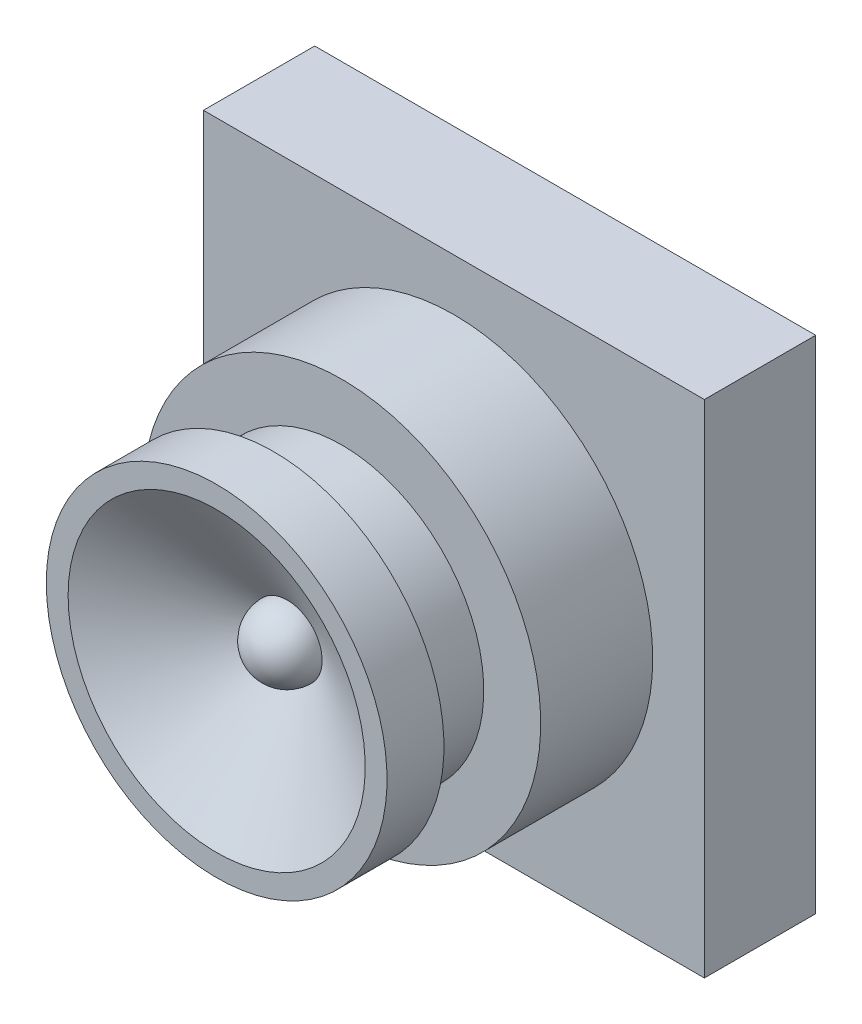
ISO-10303-21;
HEADER;
FILE_DESCRIPTION(('STEP AP214'),'2;1');
FILE_NAME('part.step','',(''),(''),'','','');
FILE_SCHEMA(('AUTOMOTIVE_DESIGN { 1 0 10303 214 1 1 1 1 }'));
ENDSEC;
DATA;
#1=APPLICATION_CONTEXT('core data for automotive mechanical design processes');
#2=APPLICATION_PROTOCOL_DEFINITION('international standard','automotive_design',2000,#1);
#3=PRODUCT_CONTEXT('',#1,'mechanical');
#4=PRODUCT('Part','Part','',(#3));
#5=PRODUCT_RELATED_PRODUCT_CATEGORY('part','',(#4));
#6=PRODUCT_DEFINITION_FORMATION('','',#4);
#7=PRODUCT_DEFINITION_CONTEXT('part definition',#1,'design');
#8=PRODUCT_DEFINITION('design','',#6,#7);
#9=PRODUCT_DEFINITION_SHAPE('','',#8);
#10=(LENGTH_UNIT() NAMED_UNIT(*) SI_UNIT(.MILLI.,.METRE.));
#11=(NAMED_UNIT(*) PLANE_ANGLE_UNIT() SI_UNIT($,.RADIAN.));
#12=(NAMED_UNIT(*) SI_UNIT($,.STERADIAN.) SOLID_ANGLE_UNIT());
#13=UNCERTAINTY_MEASURE_WITH_UNIT(LENGTH_MEASURE(1.E-05),#10,'distance_accuracy_value','');
#14=(GEOMETRIC_REPRESENTATION_CONTEXT(3) GLOBAL_UNCERTAINTY_ASSIGNED_CONTEXT((#13)) GLOBAL_UNIT_ASSIGNED_CONTEXT((#10,
#11,#12)) REPRESENTATION_CONTEXT('',''));
#15=CARTESIAN_POINT('',(0.,0.,0.));
#16=DIRECTION('',(0.,0.,1.));
#17=DIRECTION('',(1.,0.,0.));
#18=AXIS2_PLACEMENT_3D('',#15,#16,#17);
#19=CARTESIAN_POINT('',(-9.,9.,4.));
#20=DIRECTION('',(1.,0.,0.));
#21=DIRECTION('',(0.,1.,0.));
#22=AXIS2_PLACEMENT_3D('',#19,#20,#21);
#23=PLANE('',#22);
#24=DIRECTION('',(0.,-1.,0.));
#25=VECTOR('',#24,1.);
#26=CARTESIAN_POINT('',(-9.,9.,0.));
#27=LINE('',#26,#25);
#28=CARTESIAN_POINT('',(-9.,9.,0.));
#29=VERTEX_POINT('',#28);
#30=CARTESIAN_POINT('',(-9.,-9.,0.));
#31=VERTEX_POINT('',#30);
#32=EDGE_CURVE('E121',#29,#31,#27,.T.);
#33=ORIENTED_EDGE('',*,*,#32,.T.);
#34=DIRECTION('',(0.,0.,-1.));
#35=VECTOR('',#34,1.);
#36=CARTESIAN_POINT('',(-9.,-9.,4.));
#37=LINE('',#36,#35);
#38=CARTESIAN_POINT('',(-9.,-9.,4.));
#39=VERTEX_POINT('',#38);
#40=EDGE_CURVE('E42',#39,#31,#37,.T.);
#41=ORIENTED_EDGE('',*,*,#40,.F.);
#42=DIRECTION('',(0.,-1.,0.));
#43=VECTOR('',#42,1.);
#44=CARTESIAN_POINT('',(-9.,9.,4.));
#45=LINE('',#44,#43);
#46=CARTESIAN_POINT('',(-9.,9.,4.));
#47=VERTEX_POINT('',#46);
#48=EDGE_CURVE('E122',#47,#39,#45,.T.);
#49=ORIENTED_EDGE('',*,*,#48,.F.);
#50=DIRECTION('',(0.,0.,-1.));
#51=VECTOR('',#50,1.);
#52=CARTESIAN_POINT('',(-9.,9.,4.));
#53=LINE('',#52,#51);
#54=EDGE_CURVE('E128',#47,#29,#53,.T.);
#55=ORIENTED_EDGE('',*,*,#54,.T.);
#56=EDGE_LOOP('',(#33,#41,#49,#55));
#57=FACE_BOUND('',#56,.T.);
#58=ADVANCED_FACE('F34',(#57),#23,.F.);
#59=CARTESIAN_POINT('',(-9.,-9.,4.));
#60=DIRECTION('',(0.,1.,0.));
#61=DIRECTION('',(0.,0.,1.));
#62=AXIS2_PLACEMENT_3D('',#59,#60,#61);
#63=PLANE('',#62);
#64=DIRECTION('',(1.,0.,0.));
#65=VECTOR('',#64,1.);
#66=CARTESIAN_POINT('',(-9.,-9.,0.));
#67=LINE('',#66,#65);
#68=CARTESIAN_POINT('',(9.,-9.,0.));
#69=VERTEX_POINT('',#68);
#70=EDGE_CURVE('E131',#31,#69,#67,.T.);
#71=ORIENTED_EDGE('',*,*,#70,.T.);
#72=DIRECTION('',(0.,0.,-1.));
#73=VECTOR('',#72,1.);
#74=CARTESIAN_POINT('',(9.,-9.,4.));
#75=LINE('',#74,#73);
#76=CARTESIAN_POINT('',(9.,-9.,4.));
#77=VERTEX_POINT('',#76);
#78=EDGE_CURVE('E138',#77,#69,#75,.T.);
#79=ORIENTED_EDGE('',*,*,#78,.F.);
#80=DIRECTION('',(1.,0.,0.));
#81=VECTOR('',#80,1.);
#82=CARTESIAN_POINT('',(-9.,-9.,4.));
#83=LINE('',#82,#81);
#84=EDGE_CURVE('E82',#39,#77,#83,.T.);
#85=ORIENTED_EDGE('',*,*,#84,.F.);
#86=ORIENTED_EDGE('',*,*,#40,.T.);
#87=EDGE_LOOP('',(#71,#79,#85,#86));
#88=FACE_BOUND('',#87,.T.);
#89=ADVANCED_FACE('F140',(#88),#63,.F.);
#90=CARTESIAN_POINT('',(9.,9.,4.));
#91=DIRECTION('',(-1.,0.,0.));
#92=DIRECTION('',(0.,-1.,0.));
#93=AXIS2_PLACEMENT_3D('',#90,#91,#92);
#94=PLANE('',#93);
#95=DIRECTION('',(0.,1.,0.));
#96=VECTOR('',#95,1.);
#97=CARTESIAN_POINT('',(9.,9.,0.));
#98=LINE('',#97,#96);
#99=CARTESIAN_POINT('',(9.,9.,0.));
#100=VERTEX_POINT('',#99);
#101=EDGE_CURVE('E68',#69,#100,#98,.T.);
#102=ORIENTED_EDGE('',*,*,#101,.T.);
#103=DIRECTION('',(0.,0.,-1.));
#104=VECTOR('',#103,1.);
#105=CARTESIAN_POINT('',(9.,9.,4.));
#106=LINE('',#105,#104);
#107=CARTESIAN_POINT('',(9.,9.,4.));
#108=VERTEX_POINT('',#107);
#109=EDGE_CURVE('E136',#108,#100,#106,.T.);
#110=ORIENTED_EDGE('',*,*,#109,.F.);
#111=DIRECTION('',(0.,1.,0.));
#112=VECTOR('',#111,1.);
#113=CARTESIAN_POINT('',(9.,9.,4.));
#114=LINE('',#113,#112);
#115=EDGE_CURVE('E125',#77,#108,#114,.T.);
#116=ORIENTED_EDGE('',*,*,#115,.F.);
#117=ORIENTED_EDGE('',*,*,#78,.T.);
#118=EDGE_LOOP('',(#102,#110,#116,#117));
#119=FACE_BOUND('',#118,.T.);
#120=ADVANCED_FACE('F165',(#119),#94,.F.);
#121=CARTESIAN_POINT('',(-9.,9.,4.));
#122=DIRECTION('',(0.,-1.,0.));
#123=DIRECTION('',(1.,0.,0.));
#124=AXIS2_PLACEMENT_3D('',#121,#122,#123);
#125=PLANE('',#124);
#126=DIRECTION('',(-1.,0.,0.));
#127=VECTOR('',#126,1.);
#128=CARTESIAN_POINT('',(-9.,9.,0.));
#129=LINE('',#128,#127);
#130=EDGE_CURVE('E74',#100,#29,#129,.T.);
#131=ORIENTED_EDGE('',*,*,#130,.T.);
#132=ORIENTED_EDGE('',*,*,#54,.F.);
#133=DIRECTION('',(-1.,0.,0.));
#134=VECTOR('',#133,1.);
#135=CARTESIAN_POINT('',(-9.,9.,4.));
#136=LINE('',#135,#134);
#137=EDGE_CURVE('E50',#108,#47,#136,.T.);
#138=ORIENTED_EDGE('',*,*,#137,.F.);
#139=ORIENTED_EDGE('',*,*,#109,.T.);
#140=EDGE_LOOP('',(#131,#132,#138,#139));
#141=FACE_BOUND('',#140,.T.);
#142=ADVANCED_FACE('F157',(#141),#125,.F.);
#143=CARTESIAN_POINT('',(-9.,-9.,4.));
#144=DIRECTION('',(0.,0.,1.));
#145=DIRECTION('',(1.,0.,0.));
#146=AXIS2_PLACEMENT_3D('',#143,#144,#145);
#147=PLANE('',#146);
#148=CARTESIAN_POINT('',(0.,0.,4.));
#149=DIRECTION('',(0.,0.,1.));
#150=DIRECTION('',(1.,0.,0.));
#151=AXIS2_PLACEMENT_3D('',#148,#149,#150);
#152=CIRCLE('',#151,7.14368068395709);
#153=CARTESIAN_POINT('',(7.14368068395709,0.,4.));
#154=VERTEX_POINT('',#153);
#155=EDGE_CURVE('E11',#154,#154,#152,.T.);
#156=ORIENTED_EDGE('',*,*,#155,.F.);
#157=EDGE_LOOP('',(#156));
#158=FACE_BOUND('',#157,.T.);
#159=ORIENTED_EDGE('',*,*,#48,.T.);
#160=ORIENTED_EDGE('',*,*,#84,.T.);
#161=ORIENTED_EDGE('',*,*,#115,.T.);
#162=ORIENTED_EDGE('',*,*,#137,.T.);
#163=EDGE_LOOP('',(#159,#160,#161,#162));
#164=FACE_BOUND('',#163,.T.);
#165=ADVANCED_FACE('F148',(#158,#164),#147,.T.);
#166=CARTESIAN_POINT('',(-9.,-9.,0.));
#167=DIRECTION('',(0.,0.,1.));
#168=DIRECTION('',(1.,0.,0.));
#169=AXIS2_PLACEMENT_3D('',#166,#167,#168);
#170=PLANE('',#169);
#171=ORIENTED_EDGE('',*,*,#32,.F.);
#172=ORIENTED_EDGE('',*,*,#130,.F.);
#173=ORIENTED_EDGE('',*,*,#101,.F.);
#174=ORIENTED_EDGE('',*,*,#70,.F.);
#175=EDGE_LOOP('',(#171,#172,#173,#174));
#176=FACE_BOUND('',#175,.T.);
#177=ADVANCED_FACE('F145',(#176),#170,.F.);
#178=CARTESIAN_POINT('',(0.,0.,0.));
#179=DIRECTION('',(0.,0.,-1.));
#180=DIRECTION('',(-1.,0.,0.));
#181=AXIS2_PLACEMENT_3D('',#178,#179,#180);
#182=CYLINDRICAL_SURFACE('',#181,7.14368068395709);
#183=CARTESIAN_POINT('',(0.,0.,8.0246727547928));
#184=DIRECTION('',(0.,0.,-1.));
#185=DIRECTION('',(-1.,0.,0.));
#186=AXIS2_PLACEMENT_3D('',#183,#184,#185);
#187=CIRCLE('',#186,7.14368068395709);
#188=CARTESIAN_POINT('',(-7.14368068395709,0.,8.0246727547928));
#189=VERTEX_POINT('',#188);
#190=EDGE_CURVE('E118',#189,#189,#187,.T.);
#191=ORIENTED_EDGE('',*,*,#190,.T.);
#192=EDGE_LOOP('',(#191));
#193=FACE_BOUND('',#192,.T.);
#194=ORIENTED_EDGE('',*,*,#155,.T.);
#195=EDGE_LOOP('',(#194));
#196=FACE_BOUND('',#195,.T.);
#197=ADVANCED_FACE('F147',(#193,#196),#182,.T.);
#198=CARTESIAN_POINT('',(-7.14368068395709,0.,8.0246727547928));
#199=DIRECTION('',(0.,0.,1.));
#200=DIRECTION('',(1.,0.,0.));
#201=AXIS2_PLACEMENT_3D('',#198,#199,#200);
#202=PLANE('',#201);
#203=CARTESIAN_POINT('',(0.,0.,8.0246727547928));
#204=DIRECTION('',(0.,0.,-1.));
#205=DIRECTION('',(-1.,0.,0.));
#206=AXIS2_PLACEMENT_3D('',#203,#204,#205);
#207=CIRCLE('',#206,5.09873392328235);
#208=CARTESIAN_POINT('',(-5.09873392328235,0.,8.0246727547928));
#209=VERTEX_POINT('',#208);
#210=EDGE_CURVE('E115',#209,#209,#207,.T.);
#211=ORIENTED_EDGE('',*,*,#210,.T.);
#212=EDGE_LOOP('',(#211));
#213=FACE_BOUND('',#212,.T.);
#214=ORIENTED_EDGE('',*,*,#190,.F.);
#215=EDGE_LOOP('',(#214));
#216=FACE_BOUND('',#215,.T.);
#217=ADVANCED_FACE('F154',(#213,#216),#202,.T.);
#218=CARTESIAN_POINT('',(0.,0.,0.));
#219=DIRECTION('',(0.,0.,-1.));
#220=DIRECTION('',(-1.,0.,0.));
#221=AXIS2_PLACEMENT_3D('',#218,#219,#220);
#222=CYLINDRICAL_SURFACE('',#221,5.09873392328235);
#223=CARTESIAN_POINT('',(0.,0.,9.98782164504055));
#224=DIRECTION('',(0.,0.,-1.));
#225=DIRECTION('',(-1.,0.,0.));
#226=AXIS2_PLACEMENT_3D('',#223,#224,#225);
#227=CIRCLE('',#226,5.09873392328235);
#228=CARTESIAN_POINT('',(-5.09873392328235,0.,9.98782164504055));
#229=VERTEX_POINT('',#228);
#230=EDGE_CURVE('E112',#229,#229,#227,.T.);
#231=ORIENTED_EDGE('',*,*,#230,.T.);
#232=EDGE_LOOP('',(#231));
#233=FACE_BOUND('',#232,.T.);
#234=ORIENTED_EDGE('',*,*,#210,.F.);
#235=EDGE_LOOP('',(#234));
#236=FACE_BOUND('',#235,.T.);
#237=ADVANCED_FACE('F196',(#233,#236),#222,.T.);
#238=CARTESIAN_POINT('',(-5.09873392328235,0.,9.98782164504055));
#239=DIRECTION('',(0.,0.,1.));
#240=DIRECTION('',(1.,0.,0.));
#241=AXIS2_PLACEMENT_3D('',#238,#239,#240);
#242=PLANE('',#241);
#243=CARTESIAN_POINT('',(0.,0.,9.98782164504055));
#244=DIRECTION('',(0.,0.,-1.));
#245=DIRECTION('',(-1.,0.,0.));
#246=AXIS2_PLACEMENT_3D('',#243,#244,#245);
#247=CIRCLE('',#246,4.55341478710242);
#248=CARTESIAN_POINT('',(-4.55341478710242,0.,9.98782164504055));
#249=VERTEX_POINT('',#248);
#250=EDGE_CURVE('E109',#249,#249,#247,.T.);
#251=ORIENTED_EDGE('',*,*,#250,.T.);
#252=EDGE_LOOP('',(#251));
#253=FACE_BOUND('',#252,.T.);
#254=ORIENTED_EDGE('',*,*,#230,.F.);
#255=EDGE_LOOP('',(#254));
#256=FACE_BOUND('',#255,.T.);
#257=ADVANCED_FACE('F206',(#253,#256),#242,.T.);
#258=CARTESIAN_POINT('',(0.,0.,0.));
#259=DIRECTION('',(0.,0.,-1.));
#260=DIRECTION('',(-1.,0.,0.));
#261=AXIS2_PLACEMENT_3D('',#258,#259,#260);
#262=CYLINDRICAL_SURFACE('',#261,4.55341478710242);
#263=CARTESIAN_POINT('',(0.,0.,10.4786088676025));
#264=DIRECTION('',(0.,0.,-1.));
#265=DIRECTION('',(-1.,0.,0.));
#266=AXIS2_PLACEMENT_3D('',#263,#264,#265);
#267=CIRCLE('',#266,4.55341478710242);
#268=CARTESIAN_POINT('',(-4.55341478710242,0.,10.4786088676025));
#269=VERTEX_POINT('',#268);
#270=EDGE_CURVE('E106',#269,#269,#267,.T.);
#271=ORIENTED_EDGE('',*,*,#270,.T.);
#272=EDGE_LOOP('',(#271));
#273=FACE_BOUND('',#272,.T.);
#274=ORIENTED_EDGE('',*,*,#250,.F.);
#275=EDGE_LOOP('',(#274));
#276=FACE_BOUND('',#275,.T.);
#277=ADVANCED_FACE('F216',(#273,#276),#262,.T.);
#278=CARTESIAN_POINT('',(-4.55341478710242,0.,10.4786088676025));
#279=DIRECTION('',(0.,0.,-1.));
#280=DIRECTION('',(-1.,0.,0.));
#281=AXIS2_PLACEMENT_3D('',#278,#279,#280);
#282=PLANE('',#281);
#283=CARTESIAN_POINT('',(0.,0.,10.4786088676025));
#284=DIRECTION('',(0.,0.,-1.));
#285=DIRECTION('',(-1.,0.,0.));
#286=AXIS2_PLACEMENT_3D('',#283,#284,#285);
#287=CIRCLE('',#286,6.12120730361972);
#288=CARTESIAN_POINT('',(-6.12120730361972,0.,10.4786088676025));
#289=VERTEX_POINT('',#288);
#290=EDGE_CURVE('E103',#289,#289,#287,.T.);
#291=ORIENTED_EDGE('',*,*,#290,.T.);
#292=EDGE_LOOP('',(#291));
#293=FACE_BOUND('',#292,.T.);
#294=ORIENTED_EDGE('',*,*,#270,.F.);
#295=EDGE_LOOP('',(#294));
#296=FACE_BOUND('',#295,.T.);
#297=ADVANCED_FACE('F226',(#293,#296),#282,.T.);
#298=CARTESIAN_POINT('',(0.,0.,0.));
#299=DIRECTION('',(0.,0.,-1.));
#300=DIRECTION('',(-1.,0.,0.));
#301=AXIS2_PLACEMENT_3D('',#298,#299,#300);
#302=CYLINDRICAL_SURFACE('',#301,6.12120730361972);
#303=CARTESIAN_POINT('',(0.,0.,12.5235556282772));
#304=DIRECTION('',(0.,0.,-1.));
#305=DIRECTION('',(-1.,0.,0.));
#306=AXIS2_PLACEMENT_3D('',#303,#304,#305);
#307=CIRCLE('',#306,6.12120730361972);
#308=CARTESIAN_POINT('',(-6.12120730361972,0.,12.5235556282772));
#309=VERTEX_POINT('',#308);
#310=EDGE_CURVE('E98',#309,#309,#307,.T.);
#311=ORIENTED_EDGE('',*,*,#310,.T.);
#312=EDGE_LOOP('',(#311));
#313=FACE_BOUND('',#312,.T.);
#314=ORIENTED_EDGE('',*,*,#290,.F.);
#315=EDGE_LOOP('',(#314));
#316=FACE_BOUND('',#315,.T.);
#317=ADVANCED_FACE('F236',(#313,#316),#302,.T.);
#318=CARTESIAN_POINT('',(-6.12120730361972,0.,12.5235556282772));
#319=DIRECTION('',(0.,0.,1.));
#320=DIRECTION('',(1.,0.,0.));
#321=AXIS2_PLACEMENT_3D('',#318,#319,#320);
#322=PLANE('',#321);
#323=CARTESIAN_POINT('',(0.,0.,12.5235556282772));
#324=DIRECTION('',(0.,0.,-1.));
#325=DIRECTION('',(-1.,0.,0.));
#326=AXIS2_PLACEMENT_3D('',#323,#324,#325);
#327=CIRCLE('',#326,5.33731104536107);
#328=CARTESIAN_POINT('',(-5.33731104536107,0.,12.5235556282772));
#329=VERTEX_POINT('',#328);
#330=EDGE_CURVE('E95',#329,#329,#327,.T.);
#331=ORIENTED_EDGE('',*,*,#330,.T.);
#332=EDGE_LOOP('',(#331));
#333=FACE_BOUND('',#332,.T.);
#334=ORIENTED_EDGE('',*,*,#310,.F.);
#335=EDGE_LOOP('',(#334));
#336=FACE_BOUND('',#335,.T.);
#337=ADVANCED_FACE('F246',(#333,#336),#322,.T.);
#338=CARTESIAN_POINT('',(0.,0.,12.5235556282772));
#339=DIRECTION('',(0.,0.,1.));
#340=DIRECTION('',(1.,0.,0.));
#341=AXIS2_PLACEMENT_3D('',#338,#339,#340);
#342=CONICAL_SURFACE('',#341,5.33731104536107,1.01505328750826);
#343=CARTESIAN_POINT('',(0.,0.,9.98782164504055));
#344=DIRECTION('',(0.,0.,-1.));
#345=DIRECTION('',(-1.,0.,0.));
#346=AXIS2_PLACEMENT_3D('',#343,#344,#345);
#347=CIRCLE('',#346,1.25423401321384);
#348=CARTESIAN_POINT('',(-1.25423401321384,0.,9.98782164504055));
#349=VERTEX_POINT('',#348);
#350=EDGE_CURVE('E93',#349,#349,#347,.T.);
#351=ORIENTED_EDGE('',*,*,#350,.T.);
#352=EDGE_LOOP('',(#351));
#353=FACE_BOUND('',#352,.T.);
#354=ORIENTED_EDGE('',*,*,#330,.F.);
#355=EDGE_LOOP('',(#354));
#356=FACE_BOUND('',#355,.T.);
#357=ADVANCED_FACE('F89',(#353,#356),#342,.F.);
#358=CARTESIAN_POINT('',(0.00681648920224976,0.,9.9946381342428));
#359=DIRECTION('',(0.,-1.,0.));
#360=DIRECTION('',(-1.,0.,0.));
#361=AXIS2_PLACEMENT_3D('',#358,#359,#360);
#362=CIRCLE('',#361,1.26106892522531);
#363=TRIMMED_CURVE('',#362,(PARAMETER_VALUE(-1.56539097403435)),
(PARAMETER_VALUE(1.56539097403435)),.T.,.PARAMETER.);
#364=CARTESIAN_POINT('',(0.,0.,9.9946381342428));
#365=DIRECTION('',(0.,0.,-1.));
#366=AXIS1_PLACEMENT('',#364,#365);
#367=SURFACE_OF_REVOLUTION('',#363,#366);
#368=CARTESIAN_POINT('',(0.,0.,11.2556886366589));
#369=VERTEX_POINT('',#368);
#370=VERTEX_LOOP('',#369);
#371=FACE_BOUND('',#370,.T.);
#372=ORIENTED_EDGE('',*,*,#350,.F.);
#373=EDGE_LOOP('',(#372));
#374=FACE_BOUND('',#373,.T.);
#375=ADVANCED_FACE('F86',(#371,#374),#367,.T.);
#376=CLOSED_SHELL('',(#58,#89,#120,#142,#165,#177,#197,#217,#237,#257,#277,#297,#317,#337,#357,#375));
#377=MANIFOLD_SOLID_BREP('B2',#376);
#378=ADVANCED_BREP_SHAPE_REPRESENTATION('',(#18,#377),#14);
#379=SHAPE_DEFINITION_REPRESENTATION(#9,#378);
ENDSEC;
END-ISO-10303-21;
